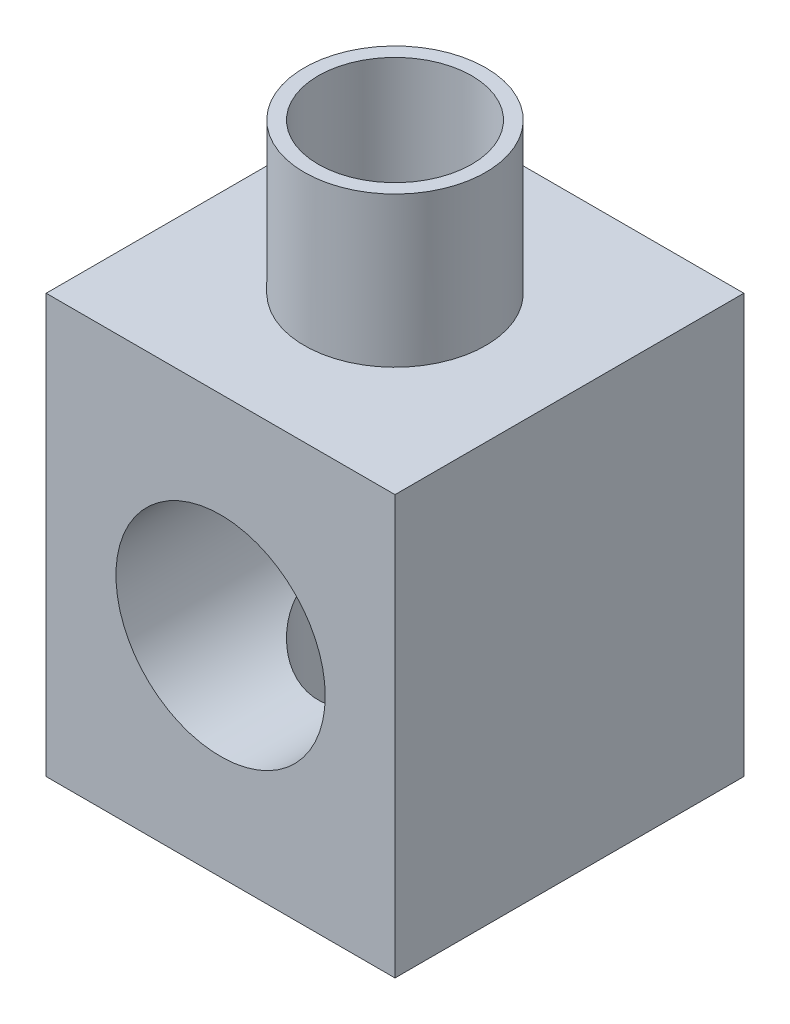
ISO-10303-21;
HEADER;
FILE_DESCRIPTION(('STEP AP214'),'2;1');
FILE_NAME('part.step','',(''),(''),'','','');
FILE_SCHEMA(('AUTOMOTIVE_DESIGN { 1 0 10303 214 1 1 1 1 }'));
ENDSEC;
DATA;
#1=APPLICATION_CONTEXT('core data for automotive mechanical design processes');
#2=APPLICATION_PROTOCOL_DEFINITION('international standard','automotive_design',2000,#1);
#3=PRODUCT_CONTEXT('',#1,'mechanical');
#4=PRODUCT('Part','Part','',(#3));
#5=PRODUCT_RELATED_PRODUCT_CATEGORY('part','',(#4));
#6=PRODUCT_DEFINITION_FORMATION('','',#4);
#7=PRODUCT_DEFINITION_CONTEXT('part definition',#1,'design');
#8=PRODUCT_DEFINITION('design','',#6,#7);
#9=PRODUCT_DEFINITION_SHAPE('','',#8);
#10=(LENGTH_UNIT() NAMED_UNIT(*) SI_UNIT(.MILLI.,.METRE.));
#11=(NAMED_UNIT(*) PLANE_ANGLE_UNIT() SI_UNIT($,.RADIAN.));
#12=(NAMED_UNIT(*) SI_UNIT($,.STERADIAN.) SOLID_ANGLE_UNIT());
#13=UNCERTAINTY_MEASURE_WITH_UNIT(LENGTH_MEASURE(1.E-05),#10,'distance_accuracy_value','');
#14=(GEOMETRIC_REPRESENTATION_CONTEXT(3) GLOBAL_UNCERTAINTY_ASSIGNED_CONTEXT((#13)) GLOBAL_UNIT_ASSIGNED_CONTEXT((#10,
#11,#12)) REPRESENTATION_CONTEXT('',''));
#15=CARTESIAN_POINT('',(0.,0.,0.));
#16=DIRECTION('',(0.,0.,1.));
#17=DIRECTION('',(1.,0.,0.));
#18=AXIS2_PLACEMENT_3D('',#15,#16,#17);
#19=CARTESIAN_POINT('',(0.,0.,0.));
#20=DIRECTION('',(0.,-1.,0.));
#21=DIRECTION('',(0.,0.,-1.));
#22=AXIS2_PLACEMENT_3D('',#19,#20,#21);
#23=PLANE('',#22);
#24=DIRECTION('',(0.,0.,-1.));
#25=VECTOR('',#24,1.);
#26=CARTESIAN_POINT('',(25.,0.,25.));
#27=LINE('',#26,#25);
#28=CARTESIAN_POINT('',(25.,0.,25.));
#29=VERTEX_POINT('',#28);
#30=CARTESIAN_POINT('',(25.,0.,-25.));
#31=VERTEX_POINT('',#30);
#32=EDGE_CURVE('E101',#29,#31,#27,.T.);
#33=ORIENTED_EDGE('',*,*,#32,.F.);
#34=DIRECTION('',(1.,0.,0.));
#35=VECTOR('',#34,1.);
#36=CARTESIAN_POINT('',(-25.,0.,25.));
#37=LINE('',#36,#35);
#38=CARTESIAN_POINT('',(-25.,0.,25.));
#39=VERTEX_POINT('',#38);
#40=EDGE_CURVE('E73',#39,#29,#37,.T.);
#41=ORIENTED_EDGE('',*,*,#40,.F.);
#42=DIRECTION('',(0.,0.,1.));
#43=VECTOR('',#42,1.);
#44=CARTESIAN_POINT('',(-25.,0.,25.));
#45=LINE('',#44,#43);
#46=CARTESIAN_POINT('',(-25.,0.,-25.));
#47=VERTEX_POINT('',#46);
#48=EDGE_CURVE('E67',#47,#39,#45,.T.);
#49=ORIENTED_EDGE('',*,*,#48,.F.);
#50=DIRECTION('',(-1.,0.,0.));
#51=VECTOR('',#50,1.);
#52=CARTESIAN_POINT('',(-25.,0.,-25.));
#53=LINE('',#52,#51);
#54=EDGE_CURVE('E92',#31,#47,#53,.T.);
#55=ORIENTED_EDGE('',*,*,#54,.F.);
#56=EDGE_LOOP('',(#33,#41,#49,#55));
#57=FACE_BOUND('',#56,.T.);
#58=CARTESIAN_POINT('',(0.,0.,0.));
#59=DIRECTION('',(0.,-1.,0.));
#60=DIRECTION('',(0.,0.,-1.));
#61=AXIS2_PLACEMENT_3D('',#58,#59,#60);
#62=CIRCLE('',#61,13.);
#63=CARTESIAN_POINT('',(0.,0.,-13.));
#64=VERTEX_POINT('',#63);
#65=EDGE_CURVE('E209',#64,#64,#62,.T.);
#66=ORIENTED_EDGE('',*,*,#65,.F.);
#67=EDGE_LOOP('',(#66));
#68=FACE_BOUND('',#67,.T.);
#69=ADVANCED_FACE('F33',(#57,#68),#23,.T.);
#70=CARTESIAN_POINT('',(0.,60.,0.));
#71=DIRECTION('',(0.,-1.,0.));
#72=DIRECTION('',(0.,0.,-1.));
#73=AXIS2_PLACEMENT_3D('',#70,#71,#72);
#74=PLANE('',#73);
#75=DIRECTION('',(0.,0.,-1.));
#76=VECTOR('',#75,1.);
#77=CARTESIAN_POINT('',(25.,60.,25.));
#78=LINE('',#77,#76);
#79=CARTESIAN_POINT('',(25.,60.,25.));
#80=VERTEX_POINT('',#79);
#81=CARTESIAN_POINT('',(25.,60.,-25.));
#82=VERTEX_POINT('',#81);
#83=EDGE_CURVE('E87',#80,#82,#78,.T.);
#84=ORIENTED_EDGE('',*,*,#83,.T.);
#85=DIRECTION('',(-1.,0.,0.));
#86=VECTOR('',#85,1.);
#87=CARTESIAN_POINT('',(-25.,60.,-25.));
#88=LINE('',#87,#86);
#89=CARTESIAN_POINT('',(-25.,60.,-25.));
#90=VERTEX_POINT('',#89);
#91=EDGE_CURVE('E81',#82,#90,#88,.T.);
#92=ORIENTED_EDGE('',*,*,#91,.T.);
#93=DIRECTION('',(0.,0.,1.));
#94=VECTOR('',#93,1.);
#95=CARTESIAN_POINT('',(-25.,60.,25.));
#96=LINE('',#95,#94);
#97=CARTESIAN_POINT('',(-25.,60.,25.));
#98=VERTEX_POINT('',#97);
#99=EDGE_CURVE('E85',#90,#98,#96,.T.);
#100=ORIENTED_EDGE('',*,*,#99,.T.);
#101=DIRECTION('',(1.,0.,0.));
#102=VECTOR('',#101,1.);
#103=CARTESIAN_POINT('',(-25.,60.,25.));
#104=LINE('',#103,#102);
#105=EDGE_CURVE('E50',#98,#80,#104,.T.);
#106=ORIENTED_EDGE('',*,*,#105,.T.);
#107=EDGE_LOOP('',(#84,#92,#100,#106));
#108=FACE_BOUND('',#107,.T.);
#109=CARTESIAN_POINT('',(0.,60.,0.));
#110=DIRECTION('',(0.,-1.,0.));
#111=DIRECTION('',(0.,0.,-1.));
#112=AXIS2_PLACEMENT_3D('',#109,#110,#111);
#113=CIRCLE('',#112,13.);
#114=CARTESIAN_POINT('',(0.,60.,-13.));
#115=VERTEX_POINT('',#114);
#116=EDGE_CURVE('E11',#115,#115,#113,.F.);
#117=ORIENTED_EDGE('',*,*,#116,.F.);
#118=EDGE_LOOP('',(#117));
#119=FACE_BOUND('',#118,.T.);
#120=ADVANCED_FACE('F82',(#108,#119),#74,.F.);
#121=CARTESIAN_POINT('',(0.,60.,0.));
#122=DIRECTION('',(0.,-1.,0.));
#123=DIRECTION('',(0.,0.,-1.));
#124=AXIS2_PLACEMENT_3D('',#121,#122,#123);
#125=CYLINDRICAL_SURFACE('',#124,11.);
#126=CARTESIAN_POINT('',(0.,45.,-11.));
#127=CARTESIAN_POINT('',(-0.270110744197477,44.9999974608303,-10.9999973598132));
#128=CARTESIAN_POINT('',(-0.540289031083577,44.9926861475496,-10.9900330358975));
#129=CARTESIAN_POINT('',(-1.07852298256454,44.9636061420586,-10.9503281218805));
#130=CARTESIAN_POINT('',(-1.34657728425868,44.9418288249369,-10.9205757337395));
#131=CARTESIAN_POINT('',(-1.87890045413597,44.8842720546229,-10.8416919257174));
#132=CARTESIAN_POINT('',(-2.14315966567923,44.8484618144854,-10.7925178946518));
#133=CARTESIAN_POINT('',(-2.66531023246231,44.763674502164,-10.6755657933803));
#134=CARTESIAN_POINT('',(-2.92320244425288,44.7146992117258,-10.607790240661));
#135=CARTESIAN_POINT('',(-3.42948944014934,44.6049752088188,-10.4550516437199));
#136=CARTESIAN_POINT('',(-3.67793191713288,44.5442988853811,-10.3701941430889));
#137=CARTESIAN_POINT('',(-4.1656309237487,44.4121947207521,-10.1840881835199));
#138=CARTESIAN_POINT('',(-4.40488717106104,44.3407665494561,-10.0828392213221));
#139=CARTESIAN_POINT('',(-4.87303226666782,44.1885203494891,-9.86509828923477));
#140=CARTESIAN_POINT('',(-5.10192760037114,44.1077083108457,-9.74861603731929));
#141=CARTESIAN_POINT('',(-5.54882577953709,43.9379946123471,-9.5013567537479));
#142=CARTESIAN_POINT('',(-5.76682453137718,43.8490899471205,-9.37057440778556));
#143=CARTESIAN_POINT('',(-6.21064733538029,43.656193400344,-9.08317046167074));
#144=CARTESIAN_POINT('',(-6.43537264867267,43.5515649961739,-8.92528014473491));
#145=CARTESIAN_POINT('',(-6.87057511640613,43.3361971657123,-8.59475849888054));
#146=CARTESIAN_POINT('',(-7.08105186451837,43.2254575653102,-8.4221267498952));
#147=CARTESIAN_POINT('',(-7.48771876466872,42.999548106547,-8.06274275394945));
#148=CARTESIAN_POINT('',(-7.68388582881398,42.8843715276567,-7.87596863696921));
#149=CARTESIAN_POINT('',(-8.06122930431745,42.6517078394712,-7.48929574231134));
#150=CARTESIAN_POINT('',(-8.24240850547928,42.5342211652332,-7.28939941964886));
#151=CARTESIAN_POINT('',(-8.6233142410747,42.2760397806092,-6.83682271283393));
#152=CARTESIAN_POINT('',(-8.81979378479981,42.1352758274895,-6.58143814538193));
#153=CARTESIAN_POINT('',(-9.19042709985845,41.8570551079099,-6.05311541619334));
#154=CARTESIAN_POINT('',(-9.36457441779558,41.7195993066941,-5.78017221455917));
#155=CARTESIAN_POINT('',(-9.68936475286764,41.4525262357434,-5.21743671570999));
#156=CARTESIAN_POINT('',(-9.84003382638042,41.3229003755644,-4.92766359410242));
#157=CARTESIAN_POINT('',(-10.1166566012415,41.0764412935123,-4.33141342721813));
#158=CARTESIAN_POINT('',(-10.2426241348075,40.9596009283906,-4.02494585396985));
#159=CARTESIAN_POINT('',(-10.4303849301875,40.7804395515241,-3.50094875371494));
#160=CARTESIAN_POINT('',(-10.4995736032209,40.7129272363569,-3.28782295039842));
#161=CARTESIAN_POINT('',(-10.6254261964559,40.5881146036255,-2.85500892750825));
#162=CARTESIAN_POINT('',(-10.6820940650719,40.5308110678474,-2.63532280159926));
#163=CARTESIAN_POINT('',(-10.7820817039136,40.428415027612,-2.19056144666434));
#164=CARTESIAN_POINT('',(-10.8254262036775,40.3832999192711,-1.96549704776561));
#165=CARTESIAN_POINT('',(-10.8981900385325,40.3069030128415,-1.5107793166227));
#166=CARTESIAN_POINT('',(-10.9276094387772,40.2756211500289,-1.28112600585465));
#167=CARTESIAN_POINT('',(-10.9721120539284,40.228090680293,-0.817016430647307));
#168=CARTESIAN_POINT('',(-10.9870803167889,40.2119626416432,-0.582536566657302));
#169=CARTESIAN_POINT('',(-11.0019364554479,40.1959559553537,-0.112547162599083));
#170=CARTESIAN_POINT('',(-11.0018249298077,40.1960766627533,0.122962336228832));
#171=CARTESIAN_POINT('',(-10.9865202663755,40.2125655147182,0.593051318056399));
#172=CARTESIAN_POINT('',(-10.9713182555288,40.2289432182349,0.827630172372136));
#173=CARTESIAN_POINT('',(-10.9261644825523,40.2771595262055,1.29374903509207));
#174=CARTESIAN_POINT('',(-10.8962110829152,40.3089998471127,1.52528870319514));
#175=CARTESIAN_POINT('',(-10.8181280568705,40.3909399355534,2.00856284757364));
#176=CARTESIAN_POINT('',(-10.7683790418364,40.4426459109178,2.25976300863489));
#177=CARTESIAN_POINT('',(-10.652520392373,40.5608077917485,2.75472275291847));
#178=CARTESIAN_POINT('',(-10.5864084566221,40.6272657718373,2.99848128410992));
#179=CARTESIAN_POINT('',(-10.364772215534,40.8450085016431,3.71799867113453));
#180=CARTESIAN_POINT('',(-10.1860597630495,41.0145359650604,4.18133017627947));
#181=CARTESIAN_POINT('',(-9.8411703503398,41.3219346670771,4.92553974275099));
#182=CARTESIAN_POINT('',(-9.68976441919441,41.4522116638623,5.21681177433259));
#183=CARTESIAN_POINT('',(-9.36334099036477,41.7205994354936,5.7822415570141));
#184=CARTESIAN_POINT('',(-9.1883158317063,41.858712743614,6.05639371284691));
#185=CARTESIAN_POINT('',(-8.81551764459025,42.1384116731292,6.5872600446896));
#186=CARTESIAN_POINT('',(-8.61772346084422,42.2800004259911,6.84395764525848));
#187=CARTESIAN_POINT('',(-8.20017083391706,42.5626731720633,7.33907558108593));
#188=CARTESIAN_POINT('',(-7.98041489964976,42.7037572210279,7.57749799861803));
#189=CARTESIAN_POINT('',(-7.51615333610881,42.983912732607,8.03840395938117));
#190=CARTESIAN_POINT('',(-7.27134120874007,43.1229273748925,8.26061387485754));
#191=CARTESIAN_POINT('',(-6.76014190729572,43.3934351502863,8.68392747509128));
#192=CARTESIAN_POINT('',(-6.49375243104769,43.5249274782486,8.88502890243165));
#193=CARTESIAN_POINT('',(-5.94075048317126,43.7767782862489,9.26388670594736));
#194=CARTESIAN_POINT('',(-5.6541783280695,43.8971579117117,9.44168770098712));
#195=CARTESIAN_POINT('',(-5.06162496703923,44.1237549894301,9.772150015994));
#196=CARTESIAN_POINT('',(-4.75565109783594,44.2299777485021,9.92482076131319));
#197=CARTESIAN_POINT('',(-4.20679991040777,44.4001034413105,10.1670234614025));
#198=CARTESIAN_POINT('',(-3.96782078515358,44.4678790152882,10.2627137403946));
#199=CARTESIAN_POINT('',(-3.48124329882184,44.5926000635484,10.4378042311076));
#200=CARTESIAN_POINT('',(-3.23364685730742,44.6495479317356,10.5172080439209));
#201=CARTESIAN_POINT('',(-2.73127838202087,44.7514667945713,10.6587138232829));
#202=CARTESIAN_POINT('',(-2.47651015327192,44.7964440126414,10.7208247809921));
#203=CARTESIAN_POINT('',(-1.96128766488453,44.8735062826463,10.8269349755309));
#204=CARTESIAN_POINT('',(-1.70083325971851,44.9055910042116,10.8709337482377));
#205=CARTESIAN_POINT('',(-1.17508411102072,44.9562425011795,10.940281264288));
#206=CARTESIAN_POINT('',(-0.909774316596427,44.9747554033694,10.9655556856344));
#207=CARTESIAN_POINT('',(-0.377406380703509,44.9976179736679,10.9967567120282));
#208=CARTESIAN_POINT('',(-0.110348241893038,45.001967663305,11.0026833464849));
#209=CARTESIAN_POINT('',(0.423344197860635,44.9963995178058,10.9950900302047));
#210=CARTESIAN_POINT('',(0.689978491736684,44.9864814472171,10.9815697585472));
#211=CARTESIAN_POINT('',(1.22066272749612,44.9526142327057,10.9353061623393));
#212=CARTESIAN_POINT('',(1.4847127469152,44.9286655110634,10.9025634163272));
#213=CARTESIAN_POINT('',(1.99230010982735,44.8691638529147,10.8209408699265));
#214=CARTESIAN_POINT('',(2.23610939080497,44.8344038983366,10.7731617380553));
#215=CARTESIAN_POINT('',(2.71816244025099,44.7536881426195,10.6617441545321));
#216=CARTESIAN_POINT('',(2.95640648231444,44.7077328931317,10.5981064843105));
#217=CARTESIAN_POINT('',(3.42603301999851,44.6054802709523,10.4557403377154));
#218=CARTESIAN_POINT('',(3.6574159053783,44.5491834870404,10.3770127204546));
#219=CARTESIAN_POINT('',(4.11235082689498,44.4271987050362,10.2052788171933));
#220=CARTESIAN_POINT('',(4.33589994377809,44.3615072513952,10.1122672763448));
#221=CARTESIAN_POINT('',(4.79159787740789,44.2162658396186,9.90495398664861));
#222=CARTESIAN_POINT('',(5.02302608318197,44.1360304158281,9.78954961237338));
#223=CARTESIAN_POINT('',(5.4749512770416,43.9672162180581,9.54416372382621));
#224=CARTESIAN_POINT('',(5.69544366423045,43.8786339771155,9.41417614791346));
#225=CARTESIAN_POINT('',(6.12486520015845,43.6945468035205,9.14061564171081));
#226=CARTESIAN_POINT('',(6.33379159958489,43.5990402372648,8.99703950311911));
#227=CARTESIAN_POINT('',(6.73962347311303,43.4025489444866,8.6971917133044));
#228=CARTESIAN_POINT('',(6.93652745590328,43.3015635412682,8.5409184926626));
#229=CARTESIAN_POINT('',(7.35294580934229,43.0766950252305,8.1866951979862));
#230=CARTESIAN_POINT('',(7.56999539027636,42.9520059139339,7.98635432383585));
#231=CARTESIAN_POINT('',(7.98643942077465,42.6994528355065,7.56990923706893));
#232=CARTESIAN_POINT('',(8.18583116706011,42.5715883860792,7.35380262004251));
#233=CARTESIAN_POINT('',(8.56673045749969,42.3151888067265,6.90634040492952));
#234=CARTESIAN_POINT('',(8.7482217973263,42.1866531780389,6.6749713009497));
#235=CARTESIAN_POINT('',(9.09263414138609,41.9318844928923,6.19762981055959));
#236=CARTESIAN_POINT('',(9.25555735428008,41.8056511640805,5.9516591662931));
#237=CARTESIAN_POINT('',(9.5466769720951,41.5711830663914,5.47098857588198));
#238=CARTESIAN_POINT('',(9.67671904693761,41.4624191630785,5.23766462148889));
#239=CARTESIAN_POINT('',(9.92061312961937,41.2519941371151,4.75956357248533));
#240=CARTESIAN_POINT('',(10.0344643903335,41.1503333423477,4.51478595003758));
#241=CARTESIAN_POINT('',(10.2448778133162,40.9573187225254,4.01447427504347));
#242=CARTESIAN_POINT('',(10.3414679144767,40.8659483317442,3.7589584469144));
#243=CARTESIAN_POINT('',(10.5163951645491,40.696740456234,3.23743689867137));
#244=CARTESIAN_POINT('',(10.5947399798539,40.6188972910718,2.97143563951238));
#245=CARTESIAN_POINT('',(10.7161005953447,40.4962293358489,2.49227930580472));
#246=CARTESIAN_POINT('',(10.7630978451311,40.4479273474125,2.28101908894396));
#247=CARTESIAN_POINT('',(10.8448258259195,40.3630705776004,1.85390952792791));
#248=CARTESIAN_POINT('',(10.8795637486937,40.3265089100588,1.63806295336276));
#249=CARTESIAN_POINT('',(10.9362045600377,40.266505757041,1.20310813816774));
#250=CARTESIAN_POINT('',(10.9581212707429,40.2430501435791,0.984003672139265));
#251=CARTESIAN_POINT('',(10.9887642181428,40.2101700764594,0.543810890515307));
#252=CARTESIAN_POINT('',(10.9974904225618,40.2007456571346,0.322722570066859));
#253=CARTESIAN_POINT('',(11.001577730153,40.1963374779368,-0.120236354253128));
#254=CARTESIAN_POINT('',(10.9969078378347,40.2013872078989,-0.342107584095333));
#255=CARTESIAN_POINT('',(10.974233744487,40.2257745530489,-0.784363706971924));
#256=CARTESIAN_POINT('',(10.9562296255898,40.2451120802309,-1.00474860915293));
#257=CARTESIAN_POINT('',(10.9072123246648,40.297280820028,-1.44267986976684));
#258=CARTESIAN_POINT('',(10.8761849079364,40.3301267968282,-1.66022285283719));
#259=CARTESIAN_POINT('',(10.8016529141427,40.408034823447,-2.09095661163474));
#260=CARTESIAN_POINT('',(10.758145127813,40.453100015212,-2.30414625279833));
#261=CARTESIAN_POINT('',(10.6451091285833,40.5683441570994,-2.78550384026919));
#262=CARTESIAN_POINT('',(10.5716973186313,40.6420191713655,-3.0519263332905));
#263=CARTESIAN_POINT('',(10.4066007199771,40.8035167601752,-3.57461208753826));
#264=CARTESIAN_POINT('',(10.3149103503141,40.8913436541136,-3.83087221718635));
#265=CARTESIAN_POINT('',(10.1142364448847,41.0779522214145,-4.3330705541883));
#266=CARTESIAN_POINT('',(10.0052156009968,41.1767573868237,-4.57898501158382));
#267=CARTESIAN_POINT('',(9.77098939880929,41.3820926684221,-5.05956860434713));
#268=CARTESIAN_POINT('',(9.64578370411759,41.4886229451528,-5.29423750584396));
#269=CARTESIAN_POINT('',(9.34379854918015,41.7363189510665,-5.81436004275057));
#270=CARTESIAN_POINT('',(9.16224442693568,41.879037851564,-6.09631113298266));
#271=CARTESIAN_POINT('',(8.77512208496417,42.1678098142591,-6.64146271614016));
#272=CARTESIAN_POINT('',(8.56954728756618,42.3138637808596,-6.90465804119156));
#273=CARTESIAN_POINT('',(8.13522031697478,42.6050194061752,-7.41144266146274));
#274=CARTESIAN_POINT('',(7.90648153236523,42.7501215639646,-7.65504313787453));
#275=CARTESIAN_POINT('',(7.42631302236132,43.0356382882479,-8.12169325353109));
#276=CARTESIAN_POINT('',(7.17488901333287,43.1760540235067,-8.34474804153731));
#277=CARTESIAN_POINT('',(6.69115256817232,43.4272359227161,-8.73552414547329));
#278=CARTESIAN_POINT('',(6.46203294364468,43.5391969321934,-8.90643572676668));
#279=CARTESIAN_POINT('',(5.98860620208572,43.7551538545753,-9.2314137838971));
#280=CARTESIAN_POINT('',(5.74430158432136,43.8591510719681,-9.38548302032597));
#281=CARTESIAN_POINT('',(5.24139468689524,44.0570534959253,-9.6753269703283));
#282=CARTESIAN_POINT('',(4.98280222880867,44.1509655075815,-9.81111403587453));
#283=CARTESIAN_POINT('',(4.45226540129276,44.3267362752663,-10.0629771089296));
#284=CARTESIAN_POINT('',(4.18032354579017,44.408597289187,-10.1790568094647));
#285=CARTESIAN_POINT('',(3.66616342350025,44.5471359201621,-10.3741573451725));
#286=CARTESIAN_POINT('',(3.42558156937486,44.6057488698396,-10.4561241668229));
#287=CARTESIAN_POINT('',(2.93706315480403,44.7117672617522,-10.6037132524074));
#288=CARTESIAN_POINT('',(2.68912794268373,44.759174744517,-10.6693384922809));
#289=CARTESIAN_POINT('',(2.18787416914334,44.8417517724116,-10.7832802445943));
#290=CARTESIAN_POINT('',(1.93456816798543,44.8769471110713,-10.8316332445519));
#291=CARTESIAN_POINT('',(1.42384932104133,44.9344774108996,-10.9105154998498));
#292=CARTESIAN_POINT('',(1.16643872476616,44.9568191832511,-10.9410541952181));
#293=CARTESIAN_POINT('',(0.75712601817307,44.9816426567374,-10.9749569849538));
#294=CARTESIAN_POINT('',(0.605954225695025,44.9885206400486,-10.984342017959));
#295=CARTESIAN_POINT('',(0.303195414754704,44.9977003111228,-10.996864658023));
#296=CARTESIAN_POINT('',(0.151608346623402,45.0000014251907,-11.0000014818898));
#297=CARTESIAN_POINT('',(0.,45.,-11.));
#298=B_SPLINE_CURVE_WITH_KNOTS('',3,(#126,#127,#128,#129,#130,#131,#132,#133,#134,#135,#136,
#137,#138,#139,#140,#141,#142,#143,#144,#145,#146,#147,#148,#149,#150,#151,#152,#153,#154,#155,
#156,#157,#158,#159,#160,#161,#162,#163,#164,#165,#166,#167,#168,#169,#170,#171,#172,#173,#174,
#175,#176,#177,#178,#179,#180,#181,#182,#183,#184,#185,#186,#187,#188,#189,#190,#191,#192,#193,
#194,#195,#196,#197,#198,#199,#200,#201,#202,#203,#204,#205,#206,#207,#208,#209,#210,#211,#212,
#213,#214,#215,#216,#217,#218,#219,#220,#221,#222,#223,#224,#225,#226,#227,#228,#229,#230,#231,
#232,#233,#234,#235,#236,#237,#238,#239,#240,#241,#242,#243,#244,#245,#246,#247,#248,#249,#250,
#251,#252,#253,#254,#255,#256,#257,#258,#259,#260,#261,#262,#263,#264,#265,#266,#267,#268,#269,
#270,#271,#272,#273,#274,#275,#276,#277,#278,#279,#280,#281,#282,#283,#284,#285,#286,#287,#288,
#289,#290,#291,#292,#293,#294,#295,#296,#297),.UNSPECIFIED.,.T.,.F.,(4,2,2,2,2,2,2,2,2,2,2,2,2,
2,2,2,2,2,2,2,2,2,2,2,2,2,2,2,2,2,2,2,2,2,2,2,2,2,2,2,2,2,2,2,2,2,2,2,2,2,2,2,2,2,2,2,2,2,2,2,2,
2,2,2,2,2,2,2,2,2,2,2,2,2,2,2,2,2,2,2,2,2,2,2,2,4),(0.,0.810169357085883,1.62082218688859,
2.43326356231595,3.24559503799466,4.05305348505196,4.86053672785752,5.66750733237119,
6.47477885511227,7.35565368833111,8.23655363103995,9.11884478509551,10.0009713403942,
11.054678178616,12.1086888261328,13.1615212611752,14.2137624433261,14.915276753358,
15.6165695253124,16.3165526545416,17.016532508614,17.7220355879629,18.4275106638218,
19.1334007978426,19.8393693082743,20.6219285659296,21.4045979472486,22.9719812598272,
24.0304407604573,25.0892444048054,26.1490398743093,27.2087144107119,28.2833999281832,
29.3582002595085,30.4309113659766,31.5032192201074,32.3010322348245,33.0986686548839,
33.8958895780711,34.6931309286872,35.4935200351391,36.2939079249769,37.0943090232898,
37.8946860331837,38.646459903409,39.3981967372506,40.1498907853306,40.9018620361347,
41.7133743758931,42.5252252867152,43.3372683585193,44.1494119557932,45.1103152385431,
46.071365374808,47.033277666074,47.9950754191168,48.8596018773335,49.7241682161878,
50.5873222378104,51.4501129181483,52.1147349620882,52.7789664636287,53.4424805526333,
54.1059962651878,54.7710484380972,55.4360965146436,56.1018734015416,56.7678216433323,
57.6245407809539,58.4815219008917,59.3403735107737,60.199242974229,61.2912128551912,
62.3834824582019,63.4751243036081,64.5664918343885,65.4865880398675,66.4065332075521,
67.325853680381,68.2450016881881,69.0266992912611,69.8082544363545,70.5881486477637,
71.3676292069321,71.822305839083,72.2770394598343),.UNSPECIFIED.);
#299=CARTESIAN_POINT('',(0.,45.,-11.));
#300=VERTEX_POINT('',#299);
#301=EDGE_CURVE('E104',#300,#300,#298,.T.);
#302=ORIENTED_EDGE('',*,*,#301,.F.);
#303=EDGE_LOOP('',(#302));
#304=FACE_BOUND('',#303,.T.);
#305=CARTESIAN_POINT('',(0.,81.5,0.));
#306=DIRECTION('',(0.,1.,0.));
#307=DIRECTION('',(0.,0.,1.));
#308=AXIS2_PLACEMENT_3D('',#305,#306,#307);
#309=CIRCLE('',#308,11.);
#310=CARTESIAN_POINT('',(0.,81.5,11.));
#311=VERTEX_POINT('',#310);
#312=EDGE_CURVE('E196',#311,#311,#309,.T.);
#313=ORIENTED_EDGE('',*,*,#312,.T.);
#314=EDGE_LOOP('',(#313));
#315=FACE_BOUND('',#314,.T.);
#316=ADVANCED_FACE('F168',(#304,#315),#125,.F.);
#317=CARTESIAN_POINT('',(25.,60.,25.));
#318=DIRECTION('',(-1.,0.,0.));
#319=DIRECTION('',(0.,0.,1.));
#320=AXIS2_PLACEMENT_3D('',#317,#318,#319);
#321=PLANE('',#320);
#322=ORIENTED_EDGE('',*,*,#32,.T.);
#323=DIRECTION('',(0.,-1.,0.));
#324=VECTOR('',#323,1.);
#325=CARTESIAN_POINT('',(25.,60.,-25.));
#326=LINE('',#325,#324);
#327=EDGE_CURVE('E42',#82,#31,#326,.T.);
#328=ORIENTED_EDGE('',*,*,#327,.F.);
#329=ORIENTED_EDGE('',*,*,#83,.F.);
#330=DIRECTION('',(0.,-1.,0.));
#331=VECTOR('',#330,1.);
#332=CARTESIAN_POINT('',(25.,60.,25.));
#333=LINE('',#332,#331);
#334=EDGE_CURVE('E97',#80,#29,#333,.T.);
#335=ORIENTED_EDGE('',*,*,#334,.T.);
#336=EDGE_LOOP('',(#322,#328,#329,#335));
#337=FACE_BOUND('',#336,.T.);
#338=ADVANCED_FACE('F35',(#337),#321,.F.);
#339=CARTESIAN_POINT('',(-25.,60.,-25.));
#340=DIRECTION('',(0.,0.,1.));
#341=DIRECTION('',(1.,0.,0.));
#342=AXIS2_PLACEMENT_3D('',#339,#340,#341);
#343=PLANE('',#342);
#344=CARTESIAN_POINT('',(0.,30.,-25.));
#345=DIRECTION('',(0.,0.,1.));
#346=DIRECTION('',(1.,0.,0.));
#347=AXIS2_PLACEMENT_3D('',#344,#345,#346);
#348=CIRCLE('',#347,4.);
#349=CARTESIAN_POINT('',(4.,30.,-25.));
#350=VERTEX_POINT('',#349);
#351=EDGE_CURVE('E185',#350,#350,#348,.T.);
#352=ORIENTED_EDGE('',*,*,#351,.T.);
#353=EDGE_LOOP('',(#352));
#354=FACE_BOUND('',#353,.T.);
#355=ORIENTED_EDGE('',*,*,#54,.T.);
#356=DIRECTION('',(0.,-1.,0.));
#357=VECTOR('',#356,1.);
#358=CARTESIAN_POINT('',(-25.,60.,-25.));
#359=LINE('',#358,#357);
#360=EDGE_CURVE('E90',#90,#47,#359,.T.);
#361=ORIENTED_EDGE('',*,*,#360,.F.);
#362=ORIENTED_EDGE('',*,*,#91,.F.);
#363=ORIENTED_EDGE('',*,*,#327,.T.);
#364=EDGE_LOOP('',(#355,#361,#362,#363));
#365=FACE_BOUND('',#364,.T.);
#366=ADVANCED_FACE('F91',(#354,#365),#343,.F.);
#367=CARTESIAN_POINT('',(-25.,60.,25.));
#368=DIRECTION('',(1.,0.,0.));
#369=DIRECTION('',(0.,0.,-1.));
#370=AXIS2_PLACEMENT_3D('',#367,#368,#369);
#371=PLANE('',#370);
#372=ORIENTED_EDGE('',*,*,#48,.T.);
#373=DIRECTION('',(0.,-1.,0.));
#374=VECTOR('',#373,1.);
#375=CARTESIAN_POINT('',(-25.,60.,25.));
#376=LINE('',#375,#374);
#377=EDGE_CURVE('E93',#98,#39,#376,.T.);
#378=ORIENTED_EDGE('',*,*,#377,.F.);
#379=ORIENTED_EDGE('',*,*,#99,.F.);
#380=ORIENTED_EDGE('',*,*,#360,.T.);
#381=EDGE_LOOP('',(#372,#378,#379,#380));
#382=FACE_BOUND('',#381,.T.);
#383=ADVANCED_FACE('F95',(#382),#371,.F.);
#384=CARTESIAN_POINT('',(-25.,60.,25.));
#385=DIRECTION('',(0.,0.,-1.));
#386=DIRECTION('',(-1.,0.,0.));
#387=AXIS2_PLACEMENT_3D('',#384,#385,#386);
#388=PLANE('',#387);
#389=CARTESIAN_POINT('',(0.,30.,25.));
#390=DIRECTION('',(0.,0.,1.));
#391=DIRECTION('',(1.,0.,0.));
#392=AXIS2_PLACEMENT_3D('',#389,#390,#391);
#393=CIRCLE('',#392,15.);
#394=CARTESIAN_POINT('',(15.,30.,25.));
#395=VERTEX_POINT('',#394);
#396=EDGE_CURVE('E187',#395,#395,#393,.T.);
#397=ORIENTED_EDGE('',*,*,#396,.F.);
#398=EDGE_LOOP('',(#397));
#399=FACE_BOUND('',#398,.T.);
#400=ORIENTED_EDGE('',*,*,#40,.T.);
#401=ORIENTED_EDGE('',*,*,#334,.F.);
#402=ORIENTED_EDGE('',*,*,#105,.F.);
#403=ORIENTED_EDGE('',*,*,#377,.T.);
#404=EDGE_LOOP('',(#400,#401,#402,#403));
#405=FACE_BOUND('',#404,.T.);
#406=ADVANCED_FACE('F172',(#399,#405),#388,.F.);
#407=CARTESIAN_POINT('',(0.,15.,-11.));
#408=CARTESIAN_POINT('',(0.270110744197477,15.0000025391697,-10.9999973598132));
#409=CARTESIAN_POINT('',(0.540289031083577,15.0073138524504,-10.9900330358975));
#410=CARTESIAN_POINT('',(1.07852298256454,15.0363938579414,-10.9503281218805));
#411=CARTESIAN_POINT('',(1.34657728425868,15.0581711750631,-10.9205757337395));
#412=CARTESIAN_POINT('',(1.87890045413597,15.1157279453771,-10.8416919257174));
#413=CARTESIAN_POINT('',(2.14315966567923,15.1515381855146,-10.7925178946518));
#414=CARTESIAN_POINT('',(2.66531023246231,15.236325497836,-10.6755657933803));
#415=CARTESIAN_POINT('',(2.92320244425288,15.2853007882742,-10.607790240661));
#416=CARTESIAN_POINT('',(3.42948944014933,15.3950247911812,-10.4550516437199));
#417=CARTESIAN_POINT('',(3.67793191713288,15.4557011146189,-10.3701941430889));
#418=CARTESIAN_POINT('',(4.1656309237487,15.5878052792479,-10.1840881835199));
#419=CARTESIAN_POINT('',(4.40488717106104,15.6592334505439,-10.0828392213221));
#420=CARTESIAN_POINT('',(4.87303226666782,15.8114796505109,-9.86509828923478));
#421=CARTESIAN_POINT('',(5.10192760037114,15.8922916891543,-9.74861603731929));
#422=CARTESIAN_POINT('',(5.54882577953709,16.0620053876529,-9.5013567537479));
#423=CARTESIAN_POINT('',(5.76682453137718,16.1509100528795,-9.37057440778556));
#424=CARTESIAN_POINT('',(6.21064733538029,16.343806599656,-9.08317046167074));
#425=CARTESIAN_POINT('',(6.43537264867267,16.4484350038261,-8.92528014473491));
#426=CARTESIAN_POINT('',(6.87057511640613,16.6638028342877,-8.59475849888054));
#427=CARTESIAN_POINT('',(7.08105186451838,16.7745424346898,-8.4221267498952));
#428=CARTESIAN_POINT('',(7.48771876466872,17.000451893453,-8.06274275394945));
#429=CARTESIAN_POINT('',(7.68388582881399,17.1156284723433,-7.87596863696921));
#430=CARTESIAN_POINT('',(8.06122930431745,17.3482921605288,-7.48929574231134));
#431=CARTESIAN_POINT('',(8.24240850547928,17.4657788347668,-7.28939941964886));
#432=CARTESIAN_POINT('',(8.6233142410747,17.7239602193908,-6.83682271283392));
#433=CARTESIAN_POINT('',(8.81979378479981,17.8647241725105,-6.58143814538193));
#434=CARTESIAN_POINT('',(9.19042709985846,18.1429448920901,-6.05311541619334));
#435=CARTESIAN_POINT('',(9.36457441779559,18.2804006933059,-5.78017221455917));
#436=CARTESIAN_POINT('',(9.68936475286764,18.5474737642566,-5.21743671570999));
#437=CARTESIAN_POINT('',(9.84003382638042,18.6770996244356,-4.92766359410242));
#438=CARTESIAN_POINT('',(10.1166566012415,18.9235587064877,-4.33141342721813));
#439=CARTESIAN_POINT('',(10.2426241348075,19.0403990716094,-4.02494585396985));
#440=CARTESIAN_POINT('',(10.4303849301875,19.2195604484759,-3.50094875371494));
#441=CARTESIAN_POINT('',(10.4995736032209,19.2870727636431,-3.28782295039842));
#442=CARTESIAN_POINT('',(10.6254261964559,19.4118853963745,-2.85500892750825));
#443=CARTESIAN_POINT('',(10.6820940650719,19.4691889321526,-2.63532280159926));
#444=CARTESIAN_POINT('',(10.7820817039136,19.571584972388,-2.19056144666434));
#445=CARTESIAN_POINT('',(10.8254262036775,19.6167000807289,-1.96549704776561));
#446=CARTESIAN_POINT('',(10.8981900385325,19.6930969871585,-1.5107793166227));
#447=CARTESIAN_POINT('',(10.9276094387772,19.7243788499711,-1.28112600585465));
#448=CARTESIAN_POINT('',(10.9721120539284,19.771909319707,-0.81701643064731));
#449=CARTESIAN_POINT('',(10.9870803167889,19.7880373583568,-0.582536566657305));
#450=CARTESIAN_POINT('',(11.0019364554479,19.8040440446463,-0.112547162599087));
#451=CARTESIAN_POINT('',(11.0018249298077,19.8039233372467,0.122962336228828));
#452=CARTESIAN_POINT('',(10.9865202663755,19.7874344852818,0.593051318056394));
#453=CARTESIAN_POINT('',(10.9713182555288,19.7710567817651,0.82763017237213));
#454=CARTESIAN_POINT('',(10.9261644825523,19.7228404737945,1.29374903509207));
#455=CARTESIAN_POINT('',(10.8962110829152,19.6910001528873,1.52528870319514));
#456=CARTESIAN_POINT('',(10.8181280568705,19.6090600644466,2.00856284757364));
#457=CARTESIAN_POINT('',(10.7683790418364,19.5573540890822,2.25976300863489));
#458=CARTESIAN_POINT('',(10.652520392373,19.4391922082515,2.75472275291847));
#459=CARTESIAN_POINT('',(10.5864084566222,19.3727342281627,2.99848128410991));
#460=CARTESIAN_POINT('',(10.364772215534,19.1549914983569,3.71799867113453));
#461=CARTESIAN_POINT('',(10.1860597630495,18.9854640349396,4.18133017627946));
#462=CARTESIAN_POINT('',(9.84117035033981,18.6780653329229,4.92553974275098));
#463=CARTESIAN_POINT('',(9.68976441919442,18.5477883361377,5.21681177433258));
#464=CARTESIAN_POINT('',(9.36334099036478,18.2794005645064,5.78224155701408));
#465=CARTESIAN_POINT('',(9.18831583170631,18.141287256386,6.0563937128469));
#466=CARTESIAN_POINT('',(8.81551764459026,17.8615883268708,6.58726004468959));
#467=CARTESIAN_POINT('',(8.61772346084423,17.7199995740089,6.84395764525847));
#468=CARTESIAN_POINT('',(8.20017083391707,17.4373268279367,7.33907558108592));
#469=CARTESIAN_POINT('',(7.98041489964977,17.2962427789721,7.57749799861801));
#470=CARTESIAN_POINT('',(7.51615333610883,17.016087267393,8.03840395938115));
#471=CARTESIAN_POINT('',(7.27134120874008,16.8770726251075,8.26061387485753));
#472=CARTESIAN_POINT('',(6.76014190729573,16.6065648497137,8.68392747509127));
#473=CARTESIAN_POINT('',(6.4937524310477,16.4750725217514,8.88502890243164));
#474=CARTESIAN_POINT('',(5.94075048317128,16.2232217137511,9.26388670594735));
#475=CARTESIAN_POINT('',(5.65417832806952,16.1028420882883,9.44168770098711));
#476=CARTESIAN_POINT('',(5.06162496703924,15.8762450105699,9.77215001599399));
#477=CARTESIAN_POINT('',(4.75565109783595,15.7700222514979,9.92482076131318));
#478=CARTESIAN_POINT('',(4.20679991040778,15.5998965586895,10.1670234614025));
#479=CARTESIAN_POINT('',(3.96782078515359,15.5321209847118,10.2627137403946));
#480=CARTESIAN_POINT('',(3.48124329882186,15.4073999364516,10.4378042311076));
#481=CARTESIAN_POINT('',(3.23364685730743,15.3504520682644,10.5172080439209));
#482=CARTESIAN_POINT('',(2.73127838202088,15.2485332054287,10.6587138232829));
#483=CARTESIAN_POINT('',(2.47651015327193,15.2035559873586,10.7208247809921));
#484=CARTESIAN_POINT('',(1.96128766488454,15.1264937173537,10.8269349755309));
#485=CARTESIAN_POINT('',(1.70083325971852,15.0944089957884,10.8709337482377));
#486=CARTESIAN_POINT('',(1.17508411102074,15.0437574988204,10.940281264288));
#487=CARTESIAN_POINT('',(0.909774316596437,15.0252445966306,10.9655556856344));
#488=CARTESIAN_POINT('',(0.377406380703518,15.0023820263321,10.9967567120282));
#489=CARTESIAN_POINT('',(0.110348241893049,14.998032336695,11.0026833464849));
#490=CARTESIAN_POINT('',(-0.423344197860622,15.0036004821942,10.9950900302047));
#491=CARTESIAN_POINT('',(-0.689978491736671,15.0135185527829,10.9815697585472));
#492=CARTESIAN_POINT('',(-1.22066272749611,15.0473857672943,10.9353061623393));
#493=CARTESIAN_POINT('',(-1.48471274691519,15.0713344889366,10.9025634163273));
#494=CARTESIAN_POINT('',(-1.99230010982734,15.1308361470853,10.8209408699265));
#495=CARTESIAN_POINT('',(-2.23610939080496,15.1655961016634,10.7731617380553));
#496=CARTESIAN_POINT('',(-2.71816244025098,15.2463118573805,10.6617441545321));
#497=CARTESIAN_POINT('',(-2.95640648231443,15.2922671068683,10.5981064843105));
#498=CARTESIAN_POINT('',(-3.4260330199985,15.3945197290477,10.4557403377154));
#499=CARTESIAN_POINT('',(-3.65741590537829,15.4508165129596,10.3770127204546));
#500=CARTESIAN_POINT('',(-4.11235082689497,15.5728012949638,10.2052788171933));
#501=CARTESIAN_POINT('',(-4.33589994377808,15.6384927486047,10.1122672763448));
#502=CARTESIAN_POINT('',(-4.79159787740788,15.7837341603814,9.90495398664862));
#503=CARTESIAN_POINT('',(-5.02302608318196,15.8639695841719,9.78954961237339));
#504=CARTESIAN_POINT('',(-5.47495127704158,16.0327837819419,9.54416372382622));
#505=CARTESIAN_POINT('',(-5.69544366423043,16.1213660228845,9.41417614791347));
#506=CARTESIAN_POINT('',(-6.12486520015844,16.3054531964795,9.14061564171082));
#507=CARTESIAN_POINT('',(-6.33379159958489,16.4009597627352,8.99703950311911));
#508=CARTESIAN_POINT('',(-6.73962347311303,16.5974510555134,8.6971917133044));
#509=CARTESIAN_POINT('',(-6.93652745590328,16.6984364587318,8.54091849266261));
#510=CARTESIAN_POINT('',(-7.35294580934228,16.9233049747695,8.18669519798621));
#511=CARTESIAN_POINT('',(-7.56999539027635,17.0479940860661,7.98635432383586));
#512=CARTESIAN_POINT('',(-7.98643942077464,17.3005471644935,7.56990923706895));
#513=CARTESIAN_POINT('',(-8.1858311670601,17.4284116139208,7.35380262004252));
#514=CARTESIAN_POINT('',(-8.56673045749968,17.6848111932735,6.90634040492953));
#515=CARTESIAN_POINT('',(-8.74822179732629,17.8133468219611,6.67497130094971));
#516=CARTESIAN_POINT('',(-9.09263414138608,18.0681155071077,6.1976298105596));
#517=CARTESIAN_POINT('',(-9.25555735428007,18.1943488359195,5.95165916629311));
#518=CARTESIAN_POINT('',(-9.54667697209509,18.4288169336086,5.47098857588199));
#519=CARTESIAN_POINT('',(-9.6767190469376,18.5375808369215,5.2376646214889));
#520=CARTESIAN_POINT('',(-9.92061312961937,18.7480058628849,4.75956357248534));
#521=CARTESIAN_POINT('',(-10.0344643903335,18.8496666576523,4.51478595003759));
#522=CARTESIAN_POINT('',(-10.2448778133162,19.0426812774746,4.01447427504348));
#523=CARTESIAN_POINT('',(-10.3414679144767,19.1340516682558,3.75895844691441));
#524=CARTESIAN_POINT('',(-10.5163951645491,19.303259543766,3.23743689867137));
#525=CARTESIAN_POINT('',(-10.5947399798539,19.3811027089282,2.97143563951239));
#526=CARTESIAN_POINT('',(-10.7161005953447,19.5037706641511,2.49227930580472));
#527=CARTESIAN_POINT('',(-10.7630978451311,19.5520726525875,2.28101908894397));
#528=CARTESIAN_POINT('',(-10.8448258259195,19.6369294223996,1.85390952792792));
#529=CARTESIAN_POINT('',(-10.8795637486937,19.6734910899412,1.63806295336277));
#530=CARTESIAN_POINT('',(-10.9362045600377,19.733494242959,1.20310813816775));
#531=CARTESIAN_POINT('',(-10.9581212707429,19.7569498564209,0.984003672139273));
#532=CARTESIAN_POINT('',(-10.9887642181428,19.7898299235406,0.543810890515313));
#533=CARTESIAN_POINT('',(-10.9974904225618,19.7992543428654,0.322722570066864));
#534=CARTESIAN_POINT('',(-11.001577730153,19.8036625220632,-0.120236354253123));
#535=CARTESIAN_POINT('',(-10.9969078378347,19.7986127921011,-0.342107584095328));
#536=CARTESIAN_POINT('',(-10.974233744487,19.7742254469511,-0.784363706971919));
#537=CARTESIAN_POINT('',(-10.9562296255898,19.7548879197691,-1.00474860915292));
#538=CARTESIAN_POINT('',(-10.9072123246648,19.702719179972,-1.44267986976684));
#539=CARTESIAN_POINT('',(-10.8761849079364,19.6698732031718,-1.66022285283718));
#540=CARTESIAN_POINT('',(-10.8016529141427,19.591965176553,-2.09095661163474));
#541=CARTESIAN_POINT('',(-10.758145127813,19.546899984788,-2.30414625279833));
#542=CARTESIAN_POINT('',(-10.6451091285833,19.4316558429006,-2.78550384026918));
#543=CARTESIAN_POINT('',(-10.5716973186313,19.3579808286345,-3.0519263332905));
#544=CARTESIAN_POINT('',(-10.4066007199771,19.1964832398248,-3.57461208753826));
#545=CARTESIAN_POINT('',(-10.3149103503141,19.1086563458864,-3.83087221718635));
#546=CARTESIAN_POINT('',(-10.1142364448847,18.9220477785855,-4.3330705541883));
#547=CARTESIAN_POINT('',(-10.0052156009968,18.8232426131763,-4.57898501158382));
#548=CARTESIAN_POINT('',(-9.77098939880929,18.6179073315779,-5.05956860434713));
#549=CARTESIAN_POINT('',(-9.64578370411759,18.5113770548472,-5.29423750584396));
#550=CARTESIAN_POINT('',(-9.34379854918015,18.2636810489335,-5.81436004275057));
#551=CARTESIAN_POINT('',(-9.16224442693568,18.120962148436,-6.09631113298266));
#552=CARTESIAN_POINT('',(-8.77512208496416,17.8321901857409,-6.64146271614016));
#553=CARTESIAN_POINT('',(-8.56954728756618,17.6861362191404,-6.90465804119156));
#554=CARTESIAN_POINT('',(-8.13522031697478,17.3949805938248,-7.41144266146274));
#555=CARTESIAN_POINT('',(-7.90648153236523,17.2498784360354,-7.65504313787453));
#556=CARTESIAN_POINT('',(-7.42631302236131,16.9643617117521,-8.12169325353109));
#557=CARTESIAN_POINT('',(-7.17488901333287,16.8239459764933,-8.34474804153732));
#558=CARTESIAN_POINT('',(-6.69115256817232,16.5727640772839,-8.7355241454733));
#559=CARTESIAN_POINT('',(-6.46203294364468,16.4608030678066,-8.90643572676669));
#560=CARTESIAN_POINT('',(-5.98860620208571,16.2448461454247,-9.23141378389711));
#561=CARTESIAN_POINT('',(-5.74430158432136,16.1408489280319,-9.38548302032597));
#562=CARTESIAN_POINT('',(-5.24139468689524,15.9429465040747,-9.6753269703283));
#563=CARTESIAN_POINT('',(-4.98280222880867,15.8490344924185,-9.81111403587453));
#564=CARTESIAN_POINT('',(-4.45226540129276,15.6732637247337,-10.0629771089296));
#565=CARTESIAN_POINT('',(-4.18032354579017,15.591402710813,-10.1790568094647));
#566=CARTESIAN_POINT('',(-3.66616342350025,15.4528640798379,-10.3741573451725));
#567=CARTESIAN_POINT('',(-3.42558156937486,15.3942511301604,-10.4561241668229));
#568=CARTESIAN_POINT('',(-2.93706315480403,15.2882327382478,-10.6037132524074));
#569=CARTESIAN_POINT('',(-2.68912794268373,15.240825255483,-10.6693384922809));
#570=CARTESIAN_POINT('',(-2.18787416914334,15.1582482275884,-10.7832802445943));
#571=CARTESIAN_POINT('',(-1.93456816798543,15.1230528889287,-10.8316332445519));
#572=CARTESIAN_POINT('',(-1.42384932104133,15.0655225891004,-10.9105154998498));
#573=CARTESIAN_POINT('',(-1.16643872476616,15.0431808167489,-10.9410541952181));
#574=CARTESIAN_POINT('',(-0.75712601817307,15.0183573432626,-10.9749569849538));
#575=CARTESIAN_POINT('',(-0.605954225695025,15.0114793599514,-10.984342017959));
#576=CARTESIAN_POINT('',(-0.303195414754704,15.0022996888771,-10.996864658023));
#577=CARTESIAN_POINT('',(-0.151608346623402,14.9999985748093,-11.0000014818898));
#578=CARTESIAN_POINT('',(0.,15.,-11.));
#579=B_SPLINE_CURVE_WITH_KNOTS('',3,(#407,#408,#409,#410,#411,#412,#413,#414,#415,#416,#417,
#418,#419,#420,#421,#422,#423,#424,#425,#426,#427,#428,#429,#430,#431,#432,#433,#434,#435,#436,
#437,#438,#439,#440,#441,#442,#443,#444,#445,#446,#447,#448,#449,#450,#451,#452,#453,#454,#455,
#456,#457,#458,#459,#460,#461,#462,#463,#464,#465,#466,#467,#468,#469,#470,#471,#472,#473,#474,
#475,#476,#477,#478,#479,#480,#481,#482,#483,#484,#485,#486,#487,#488,#489,#490,#491,#492,#493,
#494,#495,#496,#497,#498,#499,#500,#501,#502,#503,#504,#505,#506,#507,#508,#509,#510,#511,#512,
#513,#514,#515,#516,#517,#518,#519,#520,#521,#522,#523,#524,#525,#526,#527,#528,#529,#530,#531,
#532,#533,#534,#535,#536,#537,#538,#539,#540,#541,#542,#543,#544,#545,#546,#547,#548,#549,#550,
#551,#552,#553,#554,#555,#556,#557,#558,#559,#560,#561,#562,#563,#564,#565,#566,#567,#568,#569,
#570,#571,#572,#573,#574,#575,#576,#577,#578),.UNSPECIFIED.,.T.,.F.,(4,2,2,2,2,2,2,2,2,2,2,2,2,
2,2,2,2,2,2,2,2,2,2,2,2,2,2,2,2,2,2,2,2,2,2,2,2,2,2,2,2,2,2,2,2,2,2,2,2,2,2,2,2,2,2,2,2,2,2,2,2,
2,2,2,2,2,2,2,2,2,2,2,2,2,2,2,2,2,2,2,2,2,2,2,2,4),(0.,0.810169357085883,1.62082218688859,
2.43326356231595,3.24559503799466,4.05305348505196,4.86053672785752,5.66750733237119,
6.47477885511227,7.35565368833111,8.23655363103995,9.11884478509551,10.0009713403942,
11.054678178616,12.1086888261328,13.1615212611752,14.2137624433261,14.915276753358,
15.6165695253124,16.3165526545415,17.016532508614,17.7220355879629,18.4275106638218,
19.1334007978426,19.8393693082743,20.6219285659296,21.4045979472486,22.9719812598272,
24.0304407604573,25.0892444048054,26.1490398743093,27.2087144107119,28.2833999281832,
29.3582002595085,30.4309113659766,31.5032192201074,32.3010322348244,33.0986686548839,
33.8958895780711,34.6931309286872,35.4935200351391,36.2939079249768,37.0943090232898,
37.8946860331837,38.646459903409,39.3981967372506,40.1498907853306,40.9018620361347,
41.7133743758931,42.5252252867152,43.3372683585193,44.1494119557932,45.1103152385431,
46.0713653748079,47.0332776660739,47.9950754191168,48.8596018773335,49.7241682161878,
50.5873222378103,51.4501129181483,52.1147349620882,52.7789664636287,53.4424805526332,
54.1059962651878,54.7710484380972,55.4360965146436,56.1018734015416,56.7678216433323,
57.6245407809539,58.4815219008917,59.3403735107737,60.199242974229,61.2912128551912,
62.3834824582019,63.4751243036081,64.5664918343885,65.4865880398675,66.4065332075521,
67.325853680381,68.2450016881881,69.0266992912611,69.8082544363545,70.5881486477637,
71.3676292069321,71.8223058390831,72.2770394598343),.UNSPECIFIED.);
#580=CARTESIAN_POINT('',(0.,15.,-11.));
#581=VERTEX_POINT('',#580);
#582=EDGE_CURVE('E111',#581,#581,#579,.T.);
#583=ORIENTED_EDGE('',*,*,#582,.F.);
#584=EDGE_LOOP('',(#583));
#585=FACE_BOUND('',#584,.T.);
#586=CARTESIAN_POINT('',(0.,-10.,0.));
#587=DIRECTION('',(0.,-1.,0.));
#588=DIRECTION('',(0.,0.,-1.));
#589=AXIS2_PLACEMENT_3D('',#586,#587,#588);
#590=CIRCLE('',#589,11.);
#591=CARTESIAN_POINT('',(0.,-10.,-11.));
#592=VERTEX_POINT('',#591);
#593=EDGE_CURVE('E212',#592,#592,#590,.T.);
#594=ORIENTED_EDGE('',*,*,#593,.T.);
#595=EDGE_LOOP('',(#594));
#596=FACE_BOUND('',#595,.T.);
#597=ADVANCED_FACE('F123',(#585,#596),#125,.F.);
#598=CARTESIAN_POINT('',(0.,30.,-22.));
#599=DIRECTION('',(0.,0.,1.));
#600=DIRECTION('',(1.,0.,0.));
#601=AXIS2_PLACEMENT_3D('',#598,#599,#600);
#602=CYLINDRICAL_SURFACE('',#601,15.);
#603=ORIENTED_EDGE('',*,*,#301,.T.);
#604=EDGE_LOOP('',(#603));
#605=FACE_BOUND('',#604,.T.);
#606=ORIENTED_EDGE('',*,*,#582,.T.);
#607=EDGE_LOOP('',(#606));
#608=FACE_BOUND('',#607,.T.);
#609=CARTESIAN_POINT('',(0.,30.,-22.));
#610=DIRECTION('',(0.,0.,1.));
#611=DIRECTION('',(1.,0.,0.));
#612=AXIS2_PLACEMENT_3D('',#609,#610,#611);
#613=CIRCLE('',#612,15.);
#614=CARTESIAN_POINT('',(15.,30.,-22.));
#615=VERTEX_POINT('',#614);
#616=EDGE_CURVE('E119',#615,#615,#613,.T.);
#617=ORIENTED_EDGE('',*,*,#616,.F.);
#618=EDGE_LOOP('',(#617));
#619=FACE_BOUND('',#618,.T.);
#620=ORIENTED_EDGE('',*,*,#396,.T.);
#621=EDGE_LOOP('',(#620));
#622=FACE_BOUND('',#621,.T.);
#623=ADVANCED_FACE('F126',(#605,#608,#619,#622),#602,.F.);
#624=CARTESIAN_POINT('',(0.,30.,-22.));
#625=DIRECTION('',(0.,0.,1.));
#626=DIRECTION('',(1.,0.,0.));
#627=AXIS2_PLACEMENT_3D('',#624,#625,#626);
#628=PLANE('',#627);
#629=CARTESIAN_POINT('',(0.,30.,-22.));
#630=DIRECTION('',(0.,0.,1.));
#631=DIRECTION('',(1.,0.,0.));
#632=AXIS2_PLACEMENT_3D('',#629,#630,#631);
#633=CIRCLE('',#632,4.);
#634=CARTESIAN_POINT('',(4.,30.,-22.));
#635=VERTEX_POINT('',#634);
#636=EDGE_CURVE('E188',#635,#635,#633,.T.);
#637=ORIENTED_EDGE('',*,*,#636,.F.);
#638=EDGE_LOOP('',(#637));
#639=FACE_BOUND('',#638,.T.);
#640=ORIENTED_EDGE('',*,*,#616,.T.);
#641=EDGE_LOOP('',(#640));
#642=FACE_BOUND('',#641,.T.);
#643=ADVANCED_FACE('F130',(#639,#642),#628,.T.);
#644=CARTESIAN_POINT('',(0.,30.,-32.));
#645=DIRECTION('',(0.,0.,1.));
#646=DIRECTION('',(1.,0.,0.));
#647=AXIS2_PLACEMENT_3D('',#644,#645,#646);
#648=CYLINDRICAL_SURFACE('',#647,4.);
#649=ORIENTED_EDGE('',*,*,#636,.T.);
#650=EDGE_LOOP('',(#649));
#651=FACE_BOUND('',#650,.T.);
#652=ORIENTED_EDGE('',*,*,#351,.F.);
#653=EDGE_LOOP('',(#652));
#654=FACE_BOUND('',#653,.T.);
#655=ADVANCED_FACE('F135',(#651,#654),#648,.F.);
#656=CARTESIAN_POINT('',(0.,81.5,0.));
#657=DIRECTION('',(0.,1.,0.));
#658=DIRECTION('',(0.,0.,1.));
#659=AXIS2_PLACEMENT_3D('',#656,#657,#658);
#660=PLANE('',#659);
#661=CARTESIAN_POINT('',(0.,81.5,0.));
#662=DIRECTION('',(0.,1.,0.));
#663=DIRECTION('',(0.,0.,1.));
#664=AXIS2_PLACEMENT_3D('',#661,#662,#663);
#665=CIRCLE('',#664,13.);
#666=CARTESIAN_POINT('',(0.,81.5,13.));
#667=VERTEX_POINT('',#666);
#668=EDGE_CURVE('E192',#667,#667,#665,.T.);
#669=ORIENTED_EDGE('',*,*,#668,.T.);
#670=EDGE_LOOP('',(#669));
#671=FACE_BOUND('',#670,.T.);
#672=ORIENTED_EDGE('',*,*,#312,.F.);
#673=EDGE_LOOP('',(#672));
#674=FACE_BOUND('',#673,.T.);
#675=ADVANCED_FACE('F139',(#671,#674),#660,.T.);
#676=CARTESIAN_POINT('',(0.,81.5,0.));
#677=DIRECTION('',(0.,-1.,0.));
#678=DIRECTION('',(0.,0.,-1.));
#679=AXIS2_PLACEMENT_3D('',#676,#677,#678);
#680=CYLINDRICAL_SURFACE('',#679,13.);
#681=ORIENTED_EDGE('',*,*,#668,.F.);
#682=EDGE_LOOP('',(#681));
#683=FACE_BOUND('',#682,.T.);
#684=ORIENTED_EDGE('',*,*,#116,.T.);
#685=EDGE_LOOP('',(#684));
#686=FACE_BOUND('',#685,.T.);
#687=ADVANCED_FACE('F141',(#683,#686),#680,.T.);
#688=CARTESIAN_POINT('',(0.,-10.,0.));
#689=DIRECTION('',(0.,-1.,0.));
#690=DIRECTION('',(0.,0.,-1.));
#691=AXIS2_PLACEMENT_3D('',#688,#689,#690);
#692=PLANE('',#691);
#693=CARTESIAN_POINT('',(0.,-10.,0.));
#694=DIRECTION('',(0.,-1.,0.));
#695=DIRECTION('',(0.,0.,-1.));
#696=AXIS2_PLACEMENT_3D('',#693,#694,#695);
#697=CIRCLE('',#696,13.);
#698=CARTESIAN_POINT('',(0.,-10.,-13.));
#699=VERTEX_POINT('',#698);
#700=EDGE_CURVE('E208',#699,#699,#697,.T.);
#701=ORIENTED_EDGE('',*,*,#700,.T.);
#702=EDGE_LOOP('',(#701));
#703=FACE_BOUND('',#702,.T.);
#704=ORIENTED_EDGE('',*,*,#593,.F.);
#705=EDGE_LOOP('',(#704));
#706=FACE_BOUND('',#705,.T.);
#707=ADVANCED_FACE('F144',(#703,#706),#692,.T.);
#708=CARTESIAN_POINT('',(0.,-10.,0.));
#709=DIRECTION('',(0.,1.,0.));
#710=DIRECTION('',(0.,0.,1.));
#711=AXIS2_PLACEMENT_3D('',#708,#709,#710);
#712=CYLINDRICAL_SURFACE('',#711,13.);
#713=ORIENTED_EDGE('',*,*,#700,.F.);
#714=EDGE_LOOP('',(#713));
#715=FACE_BOUND('',#714,.T.);
#716=ORIENTED_EDGE('',*,*,#65,.T.);
#717=EDGE_LOOP('',(#716));
#718=FACE_BOUND('',#717,.T.);
#719=ADVANCED_FACE('F149',(#715,#718),#712,.T.);
#720=CLOSED_SHELL('',(#69,#120,#316,#338,#366,#383,#406,#597,#623,#643,#655,#675,#687,#707,#719));
#721=MANIFOLD_SOLID_BREP('B2',#720);
#722=ADVANCED_BREP_SHAPE_REPRESENTATION('',(#18,#721),#14);
#723=SHAPE_DEFINITION_REPRESENTATION(#9,#722);
ENDSEC;
END-ISO-10303-21;
